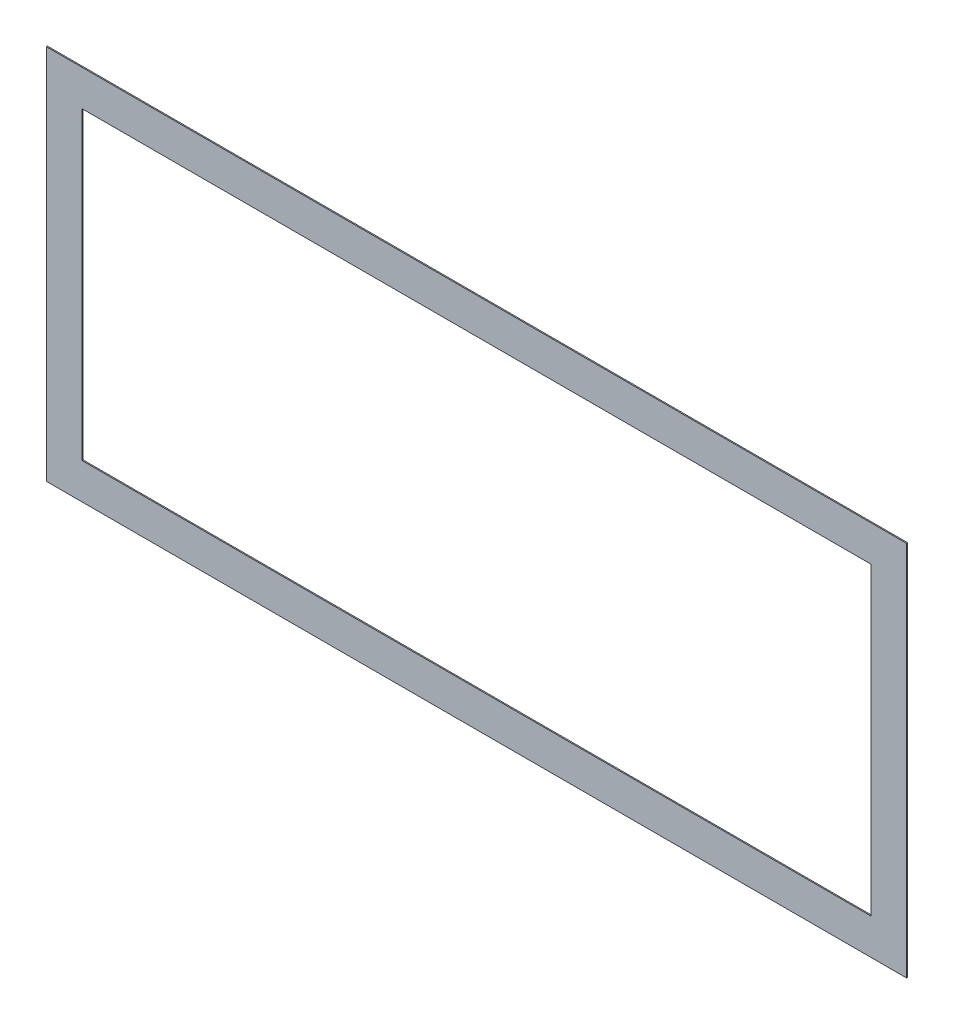
ISO-10303-21;
HEADER;
FILE_DESCRIPTION(('STEP AP214'),'2;1');
FILE_NAME('part.step','',(''),(''),'','','');
FILE_SCHEMA(('AUTOMOTIVE_DESIGN { 1 0 10303 214 1 1 1 1 }'));
ENDSEC;
DATA;
#1=APPLICATION_CONTEXT('core data for automotive mechanical design processes');
#2=APPLICATION_PROTOCOL_DEFINITION('international standard','automotive_design',2000,#1);
#3=PRODUCT_CONTEXT('',#1,'mechanical');
#4=PRODUCT('Part','Part','',(#3));
#5=PRODUCT_RELATED_PRODUCT_CATEGORY('part','',(#4));
#6=PRODUCT_DEFINITION_FORMATION('','',#4);
#7=PRODUCT_DEFINITION_CONTEXT('part definition',#1,'design');
#8=PRODUCT_DEFINITION('design','',#6,#7);
#9=PRODUCT_DEFINITION_SHAPE('','',#8);
#10=(LENGTH_UNIT() NAMED_UNIT(*) SI_UNIT(.MILLI.,.METRE.));
#11=(NAMED_UNIT(*) PLANE_ANGLE_UNIT() SI_UNIT($,.RADIAN.));
#12=(NAMED_UNIT(*) SI_UNIT($,.STERADIAN.) SOLID_ANGLE_UNIT());
#13=UNCERTAINTY_MEASURE_WITH_UNIT(LENGTH_MEASURE(1.E-05),#10,'distance_accuracy_value','');
#14=(GEOMETRIC_REPRESENTATION_CONTEXT(3) GLOBAL_UNCERTAINTY_ASSIGNED_CONTEXT((#13)) GLOBAL_UNIT_ASSIGNED_CONTEXT((#10,
#11,#12)) REPRESENTATION_CONTEXT('',''));
#15=CARTESIAN_POINT('',(0.,0.,0.));
#16=DIRECTION('',(0.,0.,1.));
#17=DIRECTION('',(1.,0.,0.));
#18=AXIS2_PLACEMENT_3D('',#15,#16,#17);
#19=CARTESIAN_POINT('',(-609.6,-266.7,-1.5875));
#20=DIRECTION('',(0.,0.,-1.));
#21=DIRECTION('',(-1.,0.,0.));
#22=AXIS2_PLACEMENT_3D('',#19,#20,#21);
#23=PLANE('',#22);
#24=DIRECTION('',(0.,1.,0.));
#25=VECTOR('',#24,1.);
#26=CARTESIAN_POINT('',(558.8,215.9,-1.5875));
#27=LINE('',#26,#25);
#28=CARTESIAN_POINT('',(558.8,-215.9,-1.5875));
#29=VERTEX_POINT('',#28);
#30=CARTESIAN_POINT('',(558.8,215.9,-1.5875));
#31=VERTEX_POINT('',#30);
#32=EDGE_CURVE('E108',#29,#31,#27,.T.);
#33=ORIENTED_EDGE('',*,*,#32,.T.);
#34=DIRECTION('',(1.,0.,0.));
#35=VECTOR('',#34,1.);
#36=CARTESIAN_POINT('',(-558.8,215.9,-1.5875));
#37=LINE('',#36,#35);
#38=CARTESIAN_POINT('',(-558.8,215.9,-1.5875));
#39=VERTEX_POINT('',#38);
#40=EDGE_CURVE('E121',#31,#39,#37,.F.);
#41=ORIENTED_EDGE('',*,*,#40,.T.);
#42=DIRECTION('',(0.,1.,0.));
#43=VECTOR('',#42,1.);
#44=CARTESIAN_POINT('',(-558.8,-215.9,-1.5875));
#45=LINE('',#44,#43);
#46=CARTESIAN_POINT('',(-558.8,-215.9,-1.5875));
#47=VERTEX_POINT('',#46);
#48=EDGE_CURVE('E114',#39,#47,#45,.F.);
#49=ORIENTED_EDGE('',*,*,#48,.T.);
#50=DIRECTION('',(1.,0.,0.));
#51=VECTOR('',#50,1.);
#52=CARTESIAN_POINT('',(558.8,-215.9,-1.5875));
#53=LINE('',#52,#51);
#54=EDGE_CURVE('E110',#47,#29,#53,.T.);
#55=ORIENTED_EDGE('',*,*,#54,.T.);
#56=EDGE_LOOP('',(#33,#41,#49,#55));
#57=FACE_BOUND('',#56,.T.);
#58=DIRECTION('',(1.,0.,0.));
#59=VECTOR('',#58,1.);
#60=CARTESIAN_POINT('',(-609.6,-266.7,-1.5875));
#61=LINE('',#60,#59);
#62=CARTESIAN_POINT('',(-609.6,-266.7,-1.5875));
#63=VERTEX_POINT('',#62);
#64=CARTESIAN_POINT('',(609.6,-266.7,-1.5875));
#65=VERTEX_POINT('',#64);
#66=EDGE_CURVE('E19',#63,#65,#61,.T.);
#67=ORIENTED_EDGE('',*,*,#66,.F.);
#68=DIRECTION('',(0.,1.,0.));
#69=VECTOR('',#68,1.);
#70=CARTESIAN_POINT('',(-609.6,0.,-1.5875));
#71=LINE('',#70,#69);
#72=CARTESIAN_POINT('',(-609.6,266.7,-1.5875));
#73=VERTEX_POINT('',#72);
#74=EDGE_CURVE('E104',#63,#73,#71,.T.);
#75=ORIENTED_EDGE('',*,*,#74,.T.);
#76=DIRECTION('',(1.,0.,0.));
#77=VECTOR('',#76,1.);
#78=CARTESIAN_POINT('',(-609.6,266.7,-1.5875));
#79=LINE('',#78,#77);
#80=CARTESIAN_POINT('',(609.6,266.7,-1.5875));
#81=VERTEX_POINT('',#80);
#82=EDGE_CURVE('E92',#81,#73,#79,.F.);
#83=ORIENTED_EDGE('',*,*,#82,.F.);
#84=DIRECTION('',(0.,1.,0.));
#85=VECTOR('',#84,1.);
#86=CARTESIAN_POINT('',(609.6,0.,-1.5875));
#87=LINE('',#86,#85);
#88=EDGE_CURVE('E79',#65,#81,#87,.T.);
#89=ORIENTED_EDGE('',*,*,#88,.F.);
#90=EDGE_LOOP('',(#67,#75,#83,#89));
#91=FACE_BOUND('',#90,.T.);
#92=ADVANCED_FACE('F16',(#57,#91),#23,.T.);
#93=CARTESIAN_POINT('',(-609.6,-266.7,0.));
#94=DIRECTION('',(0.,-1.,0.));
#95=DIRECTION('',(0.,0.,-1.));
#96=AXIS2_PLACEMENT_3D('',#93,#94,#95);
#97=PLANE('',#96);
#98=DIRECTION('',(1.,0.,0.));
#99=VECTOR('',#98,1.);
#100=CARTESIAN_POINT('',(-609.6,-266.7,0.));
#101=LINE('',#100,#99);
#102=CARTESIAN_POINT('',(-609.6,-266.7,0.));
#103=VERTEX_POINT('',#102);
#104=CARTESIAN_POINT('',(609.6,-266.7,0.));
#105=VERTEX_POINT('',#104);
#106=EDGE_CURVE('E124',#103,#105,#101,.T.);
#107=ORIENTED_EDGE('',*,*,#106,.F.);
#108=DIRECTION('',(0.,0.,-1.));
#109=VECTOR('',#108,1.);
#110=CARTESIAN_POINT('',(-609.6,-266.7,0.));
#111=LINE('',#110,#109);
#112=EDGE_CURVE('E88',#103,#63,#111,.T.);
#113=ORIENTED_EDGE('',*,*,#112,.T.);
#114=ORIENTED_EDGE('',*,*,#66,.T.);
#115=DIRECTION('',(0.,0.,-1.));
#116=VECTOR('',#115,1.);
#117=CARTESIAN_POINT('',(609.6,-266.7,0.));
#118=LINE('',#117,#116);
#119=EDGE_CURVE('E85',#105,#65,#118,.T.);
#120=ORIENTED_EDGE('',*,*,#119,.F.);
#121=EDGE_LOOP('',(#107,#113,#114,#120));
#122=FACE_BOUND('',#121,.T.);
#123=ADVANCED_FACE('F84',(#122),#97,.T.);
#124=CARTESIAN_POINT('',(609.6,0.,0.));
#125=DIRECTION('',(1.,0.,0.));
#126=DIRECTION('',(0.,0.,-1.));
#127=AXIS2_PLACEMENT_3D('',#124,#125,#126);
#128=PLANE('',#127);
#129=DIRECTION('',(0.,0.,1.));
#130=VECTOR('',#129,1.);
#131=CARTESIAN_POINT('',(609.6,266.7,-1.5875));
#132=LINE('',#131,#130);
#133=CARTESIAN_POINT('',(609.6,266.7,0.));
#134=VERTEX_POINT('',#133);
#135=EDGE_CURVE('E94',#134,#81,#132,.F.);
#136=ORIENTED_EDGE('',*,*,#135,.F.);
#137=DIRECTION('',(0.,1.,0.));
#138=VECTOR('',#137,1.);
#139=CARTESIAN_POINT('',(609.6,266.7,0.));
#140=LINE('',#139,#138);
#141=EDGE_CURVE('E98',#105,#134,#140,.T.);
#142=ORIENTED_EDGE('',*,*,#141,.F.);
#143=ORIENTED_EDGE('',*,*,#119,.T.);
#144=ORIENTED_EDGE('',*,*,#88,.T.);
#145=EDGE_LOOP('',(#136,#142,#143,#144));
#146=FACE_BOUND('',#145,.T.);
#147=ADVANCED_FACE('F96',(#146),#128,.T.);
#148=CARTESIAN_POINT('',(-609.6,266.7,-1.5875));
#149=DIRECTION('',(0.,1.,0.));
#150=DIRECTION('',(0.,0.,1.));
#151=AXIS2_PLACEMENT_3D('',#148,#149,#150);
#152=PLANE('',#151);
#153=ORIENTED_EDGE('',*,*,#82,.T.);
#154=DIRECTION('',(0.,0.,-1.));
#155=VECTOR('',#154,1.);
#156=CARTESIAN_POINT('',(-609.6,266.7,0.));
#157=LINE('',#156,#155);
#158=CARTESIAN_POINT('',(-609.6,266.7,0.));
#159=VERTEX_POINT('',#158);
#160=EDGE_CURVE('E106',#73,#159,#157,.F.);
#161=ORIENTED_EDGE('',*,*,#160,.T.);
#162=DIRECTION('',(1.,0.,0.));
#163=VECTOR('',#162,1.);
#164=CARTESIAN_POINT('',(-609.6,266.7,0.));
#165=LINE('',#164,#163);
#166=EDGE_CURVE('E127',#134,#159,#165,.F.);
#167=ORIENTED_EDGE('',*,*,#166,.F.);
#168=ORIENTED_EDGE('',*,*,#135,.T.);
#169=EDGE_LOOP('',(#153,#161,#167,#168));
#170=FACE_BOUND('',#169,.T.);
#171=ADVANCED_FACE('F175',(#170),#152,.T.);
#172=CARTESIAN_POINT('',(-609.6,0.,0.));
#173=DIRECTION('',(1.,0.,0.));
#174=DIRECTION('',(0.,0.,-1.));
#175=AXIS2_PLACEMENT_3D('',#172,#173,#174);
#176=PLANE('',#175);
#177=ORIENTED_EDGE('',*,*,#74,.F.);
#178=ORIENTED_EDGE('',*,*,#112,.F.);
#179=DIRECTION('',(0.,1.,0.));
#180=VECTOR('',#179,1.);
#181=CARTESIAN_POINT('',(-609.6,266.7,0.));
#182=LINE('',#181,#180);
#183=EDGE_CURVE('E130',#159,#103,#182,.F.);
#184=ORIENTED_EDGE('',*,*,#183,.F.);
#185=ORIENTED_EDGE('',*,*,#160,.F.);
#186=EDGE_LOOP('',(#177,#178,#184,#185));
#187=FACE_BOUND('',#186,.T.);
#188=ADVANCED_FACE('F172',(#187),#176,.F.);
#189=CARTESIAN_POINT('',(558.8,215.9,-1.5875));
#190=DIRECTION('',(1.,0.,0.));
#191=DIRECTION('',(0.,0.,-1.));
#192=AXIS2_PLACEMENT_3D('',#189,#190,#191);
#193=PLANE('',#192);
#194=ORIENTED_EDGE('',*,*,#32,.F.);
#195=DIRECTION('',(0.,0.,-1.));
#196=VECTOR('',#195,1.);
#197=CARTESIAN_POINT('',(558.8,-215.9,-1.5875));
#198=LINE('',#197,#196);
#199=CARTESIAN_POINT('',(558.8,-215.9,0.));
#200=VERTEX_POINT('',#199);
#201=EDGE_CURVE('E112',#29,#200,#198,.F.);
#202=ORIENTED_EDGE('',*,*,#201,.T.);
#203=DIRECTION('',(0.,1.,0.));
#204=VECTOR('',#203,1.);
#205=CARTESIAN_POINT('',(558.8,266.7,0.));
#206=LINE('',#205,#204);
#207=CARTESIAN_POINT('',(558.8,215.9,0.));
#208=VERTEX_POINT('',#207);
#209=EDGE_CURVE('E133',#208,#200,#206,.F.);
#210=ORIENTED_EDGE('',*,*,#209,.F.);
#211=DIRECTION('',(0.,0.,1.));
#212=VECTOR('',#211,1.);
#213=CARTESIAN_POINT('',(558.8,215.9,-1.5875));
#214=LINE('',#213,#212);
#215=EDGE_CURVE('E118',#208,#31,#214,.F.);
#216=ORIENTED_EDGE('',*,*,#215,.T.);
#217=EDGE_LOOP('',(#194,#202,#210,#216));
#218=FACE_BOUND('',#217,.T.);
#219=ADVANCED_FACE('F153',(#218),#193,.F.);
#220=CARTESIAN_POINT('',(558.8,-215.9,-1.5875));
#221=DIRECTION('',(0.,-1.,0.));
#222=DIRECTION('',(0.,0.,-1.));
#223=AXIS2_PLACEMENT_3D('',#220,#221,#222);
#224=PLANE('',#223);
#225=ORIENTED_EDGE('',*,*,#54,.F.);
#226=DIRECTION('',(0.,0.,1.));
#227=VECTOR('',#226,1.);
#228=CARTESIAN_POINT('',(-558.8,-215.9,-1.5875));
#229=LINE('',#228,#227);
#230=CARTESIAN_POINT('',(-558.8,-215.9,0.));
#231=VERTEX_POINT('',#230);
#232=EDGE_CURVE('E116',#47,#231,#229,.T.);
#233=ORIENTED_EDGE('',*,*,#232,.T.);
#234=DIRECTION('',(1.,0.,0.));
#235=VECTOR('',#234,1.);
#236=CARTESIAN_POINT('',(-609.6,-215.9,0.));
#237=LINE('',#236,#235);
#238=EDGE_CURVE('E136',#200,#231,#237,.F.);
#239=ORIENTED_EDGE('',*,*,#238,.F.);
#240=ORIENTED_EDGE('',*,*,#201,.F.);
#241=EDGE_LOOP('',(#225,#233,#239,#240));
#242=FACE_BOUND('',#241,.T.);
#243=ADVANCED_FACE('F148',(#242),#224,.F.);
#244=CARTESIAN_POINT('',(-558.8,-215.9,-1.5875));
#245=DIRECTION('',(-1.,0.,0.));
#246=DIRECTION('',(0.,0.,1.));
#247=AXIS2_PLACEMENT_3D('',#244,#245,#246);
#248=PLANE('',#247);
#249=ORIENTED_EDGE('',*,*,#48,.F.);
#250=DIRECTION('',(0.,0.,1.));
#251=VECTOR('',#250,1.);
#252=CARTESIAN_POINT('',(-558.8,215.9,-1.5875));
#253=LINE('',#252,#251);
#254=CARTESIAN_POINT('',(-558.8,215.9,0.));
#255=VERTEX_POINT('',#254);
#256=EDGE_CURVE('E34',#39,#255,#253,.T.);
#257=ORIENTED_EDGE('',*,*,#256,.T.);
#258=DIRECTION('',(0.,1.,0.));
#259=VECTOR('',#258,1.);
#260=CARTESIAN_POINT('',(-558.8,266.7,0.));
#261=LINE('',#260,#259);
#262=EDGE_CURVE('E25',#231,#255,#261,.T.);
#263=ORIENTED_EDGE('',*,*,#262,.F.);
#264=ORIENTED_EDGE('',*,*,#232,.F.);
#265=EDGE_LOOP('',(#249,#257,#263,#264));
#266=FACE_BOUND('',#265,.T.);
#267=ADVANCED_FACE('F145',(#266),#248,.F.);
#268=CARTESIAN_POINT('',(-558.8,215.9,-1.5875));
#269=DIRECTION('',(0.,1.,0.));
#270=DIRECTION('',(0.,0.,1.));
#271=AXIS2_PLACEMENT_3D('',#268,#269,#270);
#272=PLANE('',#271);
#273=ORIENTED_EDGE('',*,*,#40,.F.);
#274=ORIENTED_EDGE('',*,*,#215,.F.);
#275=DIRECTION('',(1.,0.,0.));
#276=VECTOR('',#275,1.);
#277=CARTESIAN_POINT('',(-609.6,215.9,0.));
#278=LINE('',#277,#276);
#279=EDGE_CURVE('E11',#255,#208,#278,.T.);
#280=ORIENTED_EDGE('',*,*,#279,.F.);
#281=ORIENTED_EDGE('',*,*,#256,.F.);
#282=EDGE_LOOP('',(#273,#274,#280,#281));
#283=FACE_BOUND('',#282,.T.);
#284=ADVANCED_FACE('F157',(#283),#272,.F.);
#285=CARTESIAN_POINT('',(-609.6,266.7,0.));
#286=DIRECTION('',(0.,0.,1.));
#287=DIRECTION('',(1.,0.,0.));
#288=AXIS2_PLACEMENT_3D('',#285,#286,#287);
#289=PLANE('',#288);
#290=ORIENTED_EDGE('',*,*,#262,.T.);
#291=ORIENTED_EDGE('',*,*,#279,.T.);
#292=ORIENTED_EDGE('',*,*,#209,.T.);
#293=ORIENTED_EDGE('',*,*,#238,.T.);
#294=EDGE_LOOP('',(#290,#291,#292,#293));
#295=FACE_BOUND('',#294,.T.);
#296=ORIENTED_EDGE('',*,*,#166,.T.);
#297=ORIENTED_EDGE('',*,*,#183,.T.);
#298=ORIENTED_EDGE('',*,*,#106,.T.);
#299=ORIENTED_EDGE('',*,*,#141,.T.);
#300=EDGE_LOOP('',(#296,#297,#298,#299));
#301=FACE_BOUND('',#300,.T.);
#302=ADVANCED_FACE('F141',(#295,#301),#289,.T.);
#303=CLOSED_SHELL('',(#92,#123,#147,#171,#188,#219,#243,#267,#284,#302));
#304=MANIFOLD_SOLID_BREP('B1',#303);
#305=ADVANCED_BREP_SHAPE_REPRESENTATION('',(#18,#304),#14);
#306=SHAPE_DEFINITION_REPRESENTATION(#9,#305);
ENDSEC;
END-ISO-10303-21;
